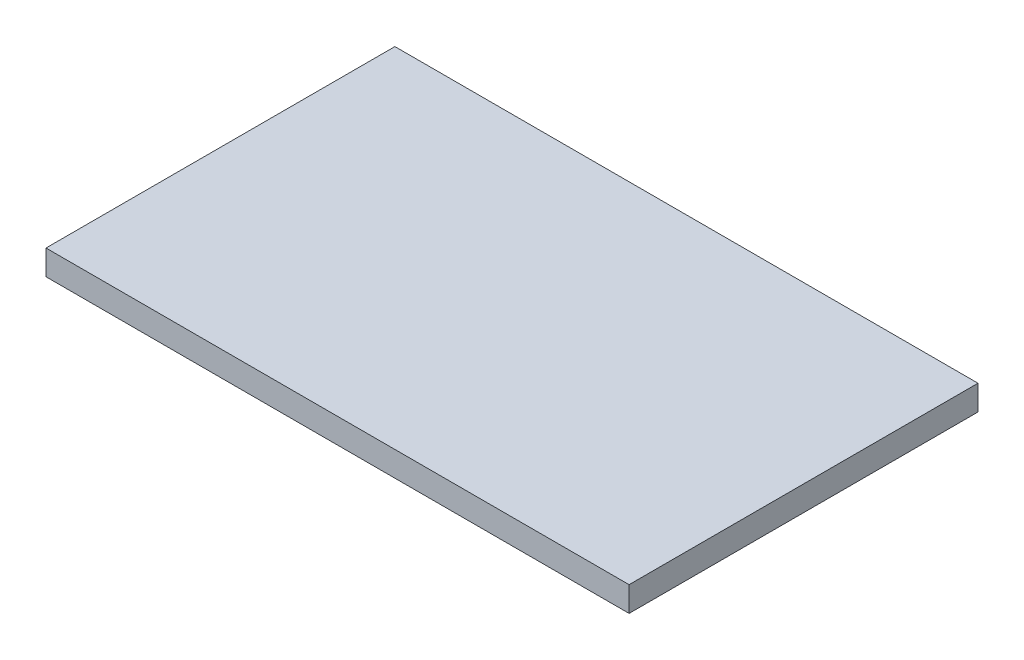
ISO-10303-21;
HEADER;
FILE_DESCRIPTION(('STEP AP214'),'2;1');
FILE_NAME('part.step','',(''),(''),'','','');
FILE_SCHEMA(('AUTOMOTIVE_DESIGN { 1 0 10303 214 1 1 1 1 }'));
ENDSEC;
DATA;
#1=APPLICATION_CONTEXT('core data for automotive mechanical design processes');
#2=APPLICATION_PROTOCOL_DEFINITION('international standard','automotive_design',2000,#1);
#3=PRODUCT_CONTEXT('',#1,'mechanical');
#4=PRODUCT('Part','Part','',(#3));
#5=PRODUCT_RELATED_PRODUCT_CATEGORY('part','',(#4));
#6=PRODUCT_DEFINITION_FORMATION('','',#4);
#7=PRODUCT_DEFINITION_CONTEXT('part definition',#1,'design');
#8=PRODUCT_DEFINITION('design','',#6,#7);
#9=PRODUCT_DEFINITION_SHAPE('','',#8);
#10=(LENGTH_UNIT() NAMED_UNIT(*) SI_UNIT(.MILLI.,.METRE.));
#11=(NAMED_UNIT(*) PLANE_ANGLE_UNIT() SI_UNIT($,.RADIAN.));
#12=(NAMED_UNIT(*) SI_UNIT($,.STERADIAN.) SOLID_ANGLE_UNIT());
#13=UNCERTAINTY_MEASURE_WITH_UNIT(LENGTH_MEASURE(1.E-05),#10,'distance_accuracy_value','');
#14=(GEOMETRIC_REPRESENTATION_CONTEXT(3) GLOBAL_UNCERTAINTY_ASSIGNED_CONTEXT((#13)) GLOBAL_UNIT_ASSIGNED_CONTEXT((#10,
#11,#12)) REPRESENTATION_CONTEXT('',''));
#15=CARTESIAN_POINT('',(0.,0.,0.));
#16=DIRECTION('',(0.,0.,1.));
#17=DIRECTION('',(1.,0.,0.));
#18=AXIS2_PLACEMENT_3D('',#15,#16,#17);
#19=CARTESIAN_POINT('',(0.,1.56,0.));
#20=DIRECTION('',(0.,0.,-1.));
#21=DIRECTION('',(-1.,0.,0.));
#22=AXIS2_PLACEMENT_3D('',#19,#20,#21);
#23=PLANE('',#22);
#24=DIRECTION('',(1.,0.,0.));
#25=VECTOR('',#24,1.);
#26=CARTESIAN_POINT('',(0.,0.,0.));
#27=LINE('',#26,#25);
#28=CARTESIAN_POINT('',(0.,0.,0.));
#29=VERTEX_POINT('',#28);
#30=CARTESIAN_POINT('',(36.5,0.,0.));
#31=VERTEX_POINT('',#30);
#32=EDGE_CURVE('E96',#29,#31,#27,.T.);
#33=ORIENTED_EDGE('',*,*,#32,.T.);
#34=DIRECTION('',(0.,-1.,0.));
#35=VECTOR('',#34,1.);
#36=CARTESIAN_POINT('',(36.5,1.56,0.));
#37=LINE('',#36,#35);
#38=CARTESIAN_POINT('',(36.5,1.56,0.));
#39=VERTEX_POINT('',#38);
#40=EDGE_CURVE('E11',#39,#31,#37,.T.);
#41=ORIENTED_EDGE('',*,*,#40,.F.);
#42=DIRECTION('',(1.,0.,0.));
#43=VECTOR('',#42,1.);
#44=CARTESIAN_POINT('',(0.,1.56,0.));
#45=LINE('',#44,#43);
#46=CARTESIAN_POINT('',(0.,1.56,0.));
#47=VERTEX_POINT('',#46);
#48=EDGE_CURVE('E82',#47,#39,#45,.T.);
#49=ORIENTED_EDGE('',*,*,#48,.F.);
#50=DIRECTION('',(0.,-1.,0.));
#51=VECTOR('',#50,1.);
#52=CARTESIAN_POINT('',(0.,1.56,0.));
#53=LINE('',#52,#51);
#54=EDGE_CURVE('E49',#47,#29,#53,.T.);
#55=ORIENTED_EDGE('',*,*,#54,.T.);
#56=EDGE_LOOP('',(#33,#41,#49,#55));
#57=FACE_BOUND('',#56,.T.);
#58=ADVANCED_FACE('F33',(#57),#23,.F.);
#59=CARTESIAN_POINT('',(36.5,1.56,0.));
#60=DIRECTION('',(-1.,0.,0.));
#61=DIRECTION('',(0.,0.,1.));
#62=AXIS2_PLACEMENT_3D('',#59,#60,#61);
#63=PLANE('',#62);
#64=DIRECTION('',(0.,0.,-1.));
#65=VECTOR('',#64,1.);
#66=CARTESIAN_POINT('',(36.5,0.,0.));
#67=LINE('',#66,#65);
#68=CARTESIAN_POINT('',(36.5,0.,-21.84));
#69=VERTEX_POINT('',#68);
#70=EDGE_CURVE('E87',#31,#69,#67,.T.);
#71=ORIENTED_EDGE('',*,*,#70,.T.);
#72=DIRECTION('',(0.,-1.,0.));
#73=VECTOR('',#72,1.);
#74=CARTESIAN_POINT('',(36.5,1.56,-21.84));
#75=LINE('',#74,#73);
#76=CARTESIAN_POINT('',(36.5,1.56,-21.84));
#77=VERTEX_POINT('',#76);
#78=EDGE_CURVE('E41',#77,#69,#75,.T.);
#79=ORIENTED_EDGE('',*,*,#78,.F.);
#80=DIRECTION('',(0.,0.,-1.));
#81=VECTOR('',#80,1.);
#82=CARTESIAN_POINT('',(36.5,1.56,0.));
#83=LINE('',#82,#81);
#84=EDGE_CURVE('E74',#39,#77,#83,.T.);
#85=ORIENTED_EDGE('',*,*,#84,.F.);
#86=ORIENTED_EDGE('',*,*,#40,.T.);
#87=EDGE_LOOP('',(#71,#79,#85,#86));
#88=FACE_BOUND('',#87,.T.);
#89=ADVANCED_FACE('F86',(#88),#63,.F.);
#90=CARTESIAN_POINT('',(0.,1.56,-21.84));
#91=DIRECTION('',(0.,0.,-1.));
#92=DIRECTION('',(-1.,0.,0.));
#93=AXIS2_PLACEMENT_3D('',#90,#91,#92);
#94=PLANE('',#93);
#95=DIRECTION('',(1.,0.,0.));
#96=VECTOR('',#95,1.);
#97=CARTESIAN_POINT('',(0.,0.,-21.84));
#98=LINE('',#97,#96);
#99=CARTESIAN_POINT('',(0.,0.,-21.84));
#100=VERTEX_POINT('',#99);
#101=EDGE_CURVE('E99',#100,#69,#98,.T.);
#102=ORIENTED_EDGE('',*,*,#101,.F.);
#103=DIRECTION('',(0.,-1.,0.));
#104=VECTOR('',#103,1.);
#105=CARTESIAN_POINT('',(0.,1.56,-21.84));
#106=LINE('',#105,#104);
#107=CARTESIAN_POINT('',(0.,1.56,-21.84));
#108=VERTEX_POINT('',#107);
#109=EDGE_CURVE('E63',#108,#100,#106,.T.);
#110=ORIENTED_EDGE('',*,*,#109,.F.);
#111=DIRECTION('',(1.,0.,0.));
#112=VECTOR('',#111,1.);
#113=CARTESIAN_POINT('',(0.,1.56,-21.84));
#114=LINE('',#113,#112);
#115=EDGE_CURVE('E81',#108,#77,#114,.T.);
#116=ORIENTED_EDGE('',*,*,#115,.T.);
#117=ORIENTED_EDGE('',*,*,#78,.T.);
#118=EDGE_LOOP('',(#102,#110,#116,#117));
#119=FACE_BOUND('',#118,.T.);
#120=ADVANCED_FACE('F90',(#119),#94,.T.);
#121=CARTESIAN_POINT('',(0.,1.56,0.));
#122=DIRECTION('',(-1.,0.,0.));
#123=DIRECTION('',(0.,0.,1.));
#124=AXIS2_PLACEMENT_3D('',#121,#122,#123);
#125=PLANE('',#124);
#126=DIRECTION('',(0.,0.,-1.));
#127=VECTOR('',#126,1.);
#128=CARTESIAN_POINT('',(0.,0.,0.));
#129=LINE('',#128,#127);
#130=EDGE_CURVE('E101',#29,#100,#129,.T.);
#131=ORIENTED_EDGE('',*,*,#130,.F.);
#132=ORIENTED_EDGE('',*,*,#54,.F.);
#133=DIRECTION('',(0.,0.,-1.));
#134=VECTOR('',#133,1.);
#135=CARTESIAN_POINT('',(0.,1.56,0.));
#136=LINE('',#135,#134);
#137=EDGE_CURVE('E91',#47,#108,#136,.T.);
#138=ORIENTED_EDGE('',*,*,#137,.T.);
#139=ORIENTED_EDGE('',*,*,#109,.T.);
#140=EDGE_LOOP('',(#131,#132,#138,#139));
#141=FACE_BOUND('',#140,.T.);
#142=ADVANCED_FACE('F107',(#141),#125,.T.);
#143=CARTESIAN_POINT('',(0.,1.56,0.));
#144=DIRECTION('',(0.,1.,0.));
#145=DIRECTION('',(0.,0.,1.));
#146=AXIS2_PLACEMENT_3D('',#143,#144,#145);
#147=PLANE('',#146);
#148=ORIENTED_EDGE('',*,*,#48,.T.);
#149=ORIENTED_EDGE('',*,*,#84,.T.);
#150=ORIENTED_EDGE('',*,*,#115,.F.);
#151=ORIENTED_EDGE('',*,*,#137,.F.);
#152=EDGE_LOOP('',(#148,#149,#150,#151));
#153=FACE_BOUND('',#152,.T.);
#154=ADVANCED_FACE('F78',(#153),#147,.T.);
#155=CARTESIAN_POINT('',(0.,0.,0.));
#156=DIRECTION('',(0.,1.,0.));
#157=DIRECTION('',(0.,0.,1.));
#158=AXIS2_PLACEMENT_3D('',#155,#156,#157);
#159=PLANE('',#158);
#160=ORIENTED_EDGE('',*,*,#32,.F.);
#161=ORIENTED_EDGE('',*,*,#130,.T.);
#162=ORIENTED_EDGE('',*,*,#101,.T.);
#163=ORIENTED_EDGE('',*,*,#70,.F.);
#164=EDGE_LOOP('',(#160,#161,#162,#163));
#165=FACE_BOUND('',#164,.T.);
#166=ADVANCED_FACE('F106',(#165),#159,.F.);
#167=CLOSED_SHELL('',(#58,#89,#120,#142,#154,#166));
#168=MANIFOLD_SOLID_BREP('B2',#167);
#169=ADVANCED_BREP_SHAPE_REPRESENTATION('',(#18,#168),#14);
#170=SHAPE_DEFINITION_REPRESENTATION(#9,#169);
ENDSEC;
END-ISO-10303-21;
